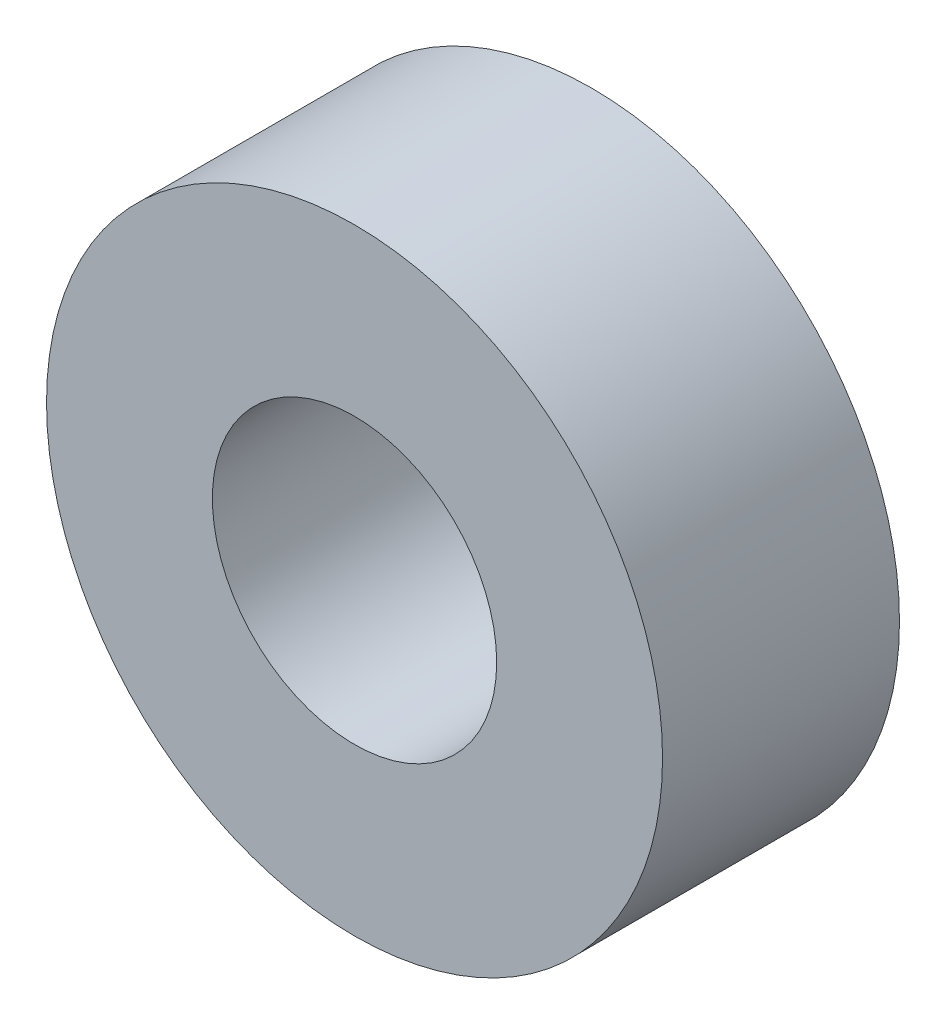
ISO-10303-21;
HEADER;
FILE_DESCRIPTION(('STEP AP214'),'2;1');
FILE_NAME('part.step','',(''),(''),'','','');
FILE_SCHEMA(('AUTOMOTIVE_DESIGN { 1 0 10303 214 1 1 1 1 }'));
ENDSEC;
DATA;
#1=APPLICATION_CONTEXT('core data for automotive mechanical design processes');
#2=APPLICATION_PROTOCOL_DEFINITION('international standard','automotive_design',2000,#1);
#3=PRODUCT_CONTEXT('',#1,'mechanical');
#4=PRODUCT('Part','Part','',(#3));
#5=PRODUCT_RELATED_PRODUCT_CATEGORY('part','',(#4));
#6=PRODUCT_DEFINITION_FORMATION('','',#4);
#7=PRODUCT_DEFINITION_CONTEXT('part definition',#1,'design');
#8=PRODUCT_DEFINITION('design','',#6,#7);
#9=PRODUCT_DEFINITION_SHAPE('','',#8);
#10=(LENGTH_UNIT() NAMED_UNIT(*) SI_UNIT(.MILLI.,.METRE.));
#11=(NAMED_UNIT(*) PLANE_ANGLE_UNIT() SI_UNIT($,.RADIAN.));
#12=(NAMED_UNIT(*) SI_UNIT($,.STERADIAN.) SOLID_ANGLE_UNIT());
#13=UNCERTAINTY_MEASURE_WITH_UNIT(LENGTH_MEASURE(1.E-05),#10,'distance_accuracy_value','');
#14=(GEOMETRIC_REPRESENTATION_CONTEXT(3) GLOBAL_UNCERTAINTY_ASSIGNED_CONTEXT((#13)) GLOBAL_UNIT_ASSIGNED_CONTEXT((#10,
#11,#12)) REPRESENTATION_CONTEXT('',''));
#15=CARTESIAN_POINT('',(0.,0.,0.));
#16=DIRECTION('',(0.,0.,1.));
#17=DIRECTION('',(1.,0.,0.));
#18=AXIS2_PLACEMENT_3D('',#15,#16,#17);
#19=CARTESIAN_POINT('',(0.,0.,2.5));
#20=DIRECTION('',(0.,0.,1.));
#21=DIRECTION('',(1.,0.,0.));
#22=AXIS2_PLACEMENT_3D('',#19,#20,#21);
#23=PLANE('',#22);
#24=CARTESIAN_POINT('',(0.,0.,2.5));
#25=DIRECTION('',(0.,0.,1.));
#26=DIRECTION('',(1.,0.,0.));
#27=AXIS2_PLACEMENT_3D('',#24,#25,#26);
#28=CIRCLE('',#27,6.5);
#29=CARTESIAN_POINT('',(6.5,0.,2.5));
#30=VERTEX_POINT('',#29);
#31=EDGE_CURVE('E10',#30,#30,#28,.T.);
#32=ORIENTED_EDGE('',*,*,#31,.T.);
#33=EDGE_LOOP('',(#32));
#34=FACE_BOUND('',#33,.T.);
#35=CARTESIAN_POINT('',(0.,0.,2.5));
#36=DIRECTION('',(0.,0.,1.));
#37=DIRECTION('',(1.,0.,0.));
#38=AXIS2_PLACEMENT_3D('',#35,#36,#37);
#39=CIRCLE('',#38,3.);
#40=CARTESIAN_POINT('',(3.,0.,2.5));
#41=VERTEX_POINT('',#40);
#42=EDGE_CURVE('E45',#41,#41,#39,.T.);
#43=ORIENTED_EDGE('',*,*,#42,.F.);
#44=EDGE_LOOP('',(#43));
#45=FACE_BOUND('',#44,.T.);
#46=ADVANCED_FACE('F34',(#34,#45),#23,.T.);
#47=CARTESIAN_POINT('',(0.,0.,-2.5));
#48=DIRECTION('',(0.,0.,1.));
#49=DIRECTION('',(1.,0.,0.));
#50=AXIS2_PLACEMENT_3D('',#47,#48,#49);
#51=PLANE('',#50);
#52=CARTESIAN_POINT('',(0.,0.,-2.5));
#53=DIRECTION('',(0.,0.,1.));
#54=DIRECTION('',(1.,0.,0.));
#55=AXIS2_PLACEMENT_3D('',#52,#53,#54);
#56=CIRCLE('',#55,6.5);
#57=CARTESIAN_POINT('',(6.5,0.,-2.5));
#58=VERTEX_POINT('',#57);
#59=EDGE_CURVE('E38',#58,#58,#56,.T.);
#60=ORIENTED_EDGE('',*,*,#59,.F.);
#61=EDGE_LOOP('',(#60));
#62=FACE_BOUND('',#61,.T.);
#63=CARTESIAN_POINT('',(0.,0.,-2.5));
#64=DIRECTION('',(0.,0.,1.));
#65=DIRECTION('',(1.,0.,0.));
#66=AXIS2_PLACEMENT_3D('',#63,#64,#65);
#67=CIRCLE('',#66,3.);
#68=CARTESIAN_POINT('',(3.,0.,-2.5));
#69=VERTEX_POINT('',#68);
#70=EDGE_CURVE('E47',#69,#69,#67,.T.);
#71=ORIENTED_EDGE('',*,*,#70,.T.);
#72=EDGE_LOOP('',(#71));
#73=FACE_BOUND('',#72,.T.);
#74=ADVANCED_FACE('F57',(#62,#73),#51,.F.);
#75=CARTESIAN_POINT('',(0.,0.,2.5));
#76=DIRECTION('',(0.,0.,-1.));
#77=DIRECTION('',(-1.,0.,0.));
#78=AXIS2_PLACEMENT_3D('',#75,#76,#77);
#79=CYLINDRICAL_SURFACE('',#78,6.5);
#80=ORIENTED_EDGE('',*,*,#31,.F.);
#81=EDGE_LOOP('',(#80));
#82=FACE_BOUND('',#81,.T.);
#83=ORIENTED_EDGE('',*,*,#59,.T.);
#84=EDGE_LOOP('',(#83));
#85=FACE_BOUND('',#84,.T.);
#86=ADVANCED_FACE('F36',(#82,#85),#79,.T.);
#87=CARTESIAN_POINT('',(0.,0.,2.5));
#88=DIRECTION('',(0.,0.,-1.));
#89=DIRECTION('',(-1.,0.,0.));
#90=AXIS2_PLACEMENT_3D('',#87,#88,#89);
#91=CYLINDRICAL_SURFACE('',#90,3.);
#92=ORIENTED_EDGE('',*,*,#42,.T.);
#93=EDGE_LOOP('',(#92));
#94=FACE_BOUND('',#93,.T.);
#95=ORIENTED_EDGE('',*,*,#70,.F.);
#96=EDGE_LOOP('',(#95));
#97=FACE_BOUND('',#96,.T.);
#98=ADVANCED_FACE('F53',(#94,#97),#91,.F.);
#99=CLOSED_SHELL('',(#46,#74,#86,#98));
#100=MANIFOLD_SOLID_BREP('B2',#99);
#101=ADVANCED_BREP_SHAPE_REPRESENTATION('',(#18,#100),#14);
#102=SHAPE_DEFINITION_REPRESENTATION(#9,#101);
ENDSEC;
END-ISO-10303-21;
